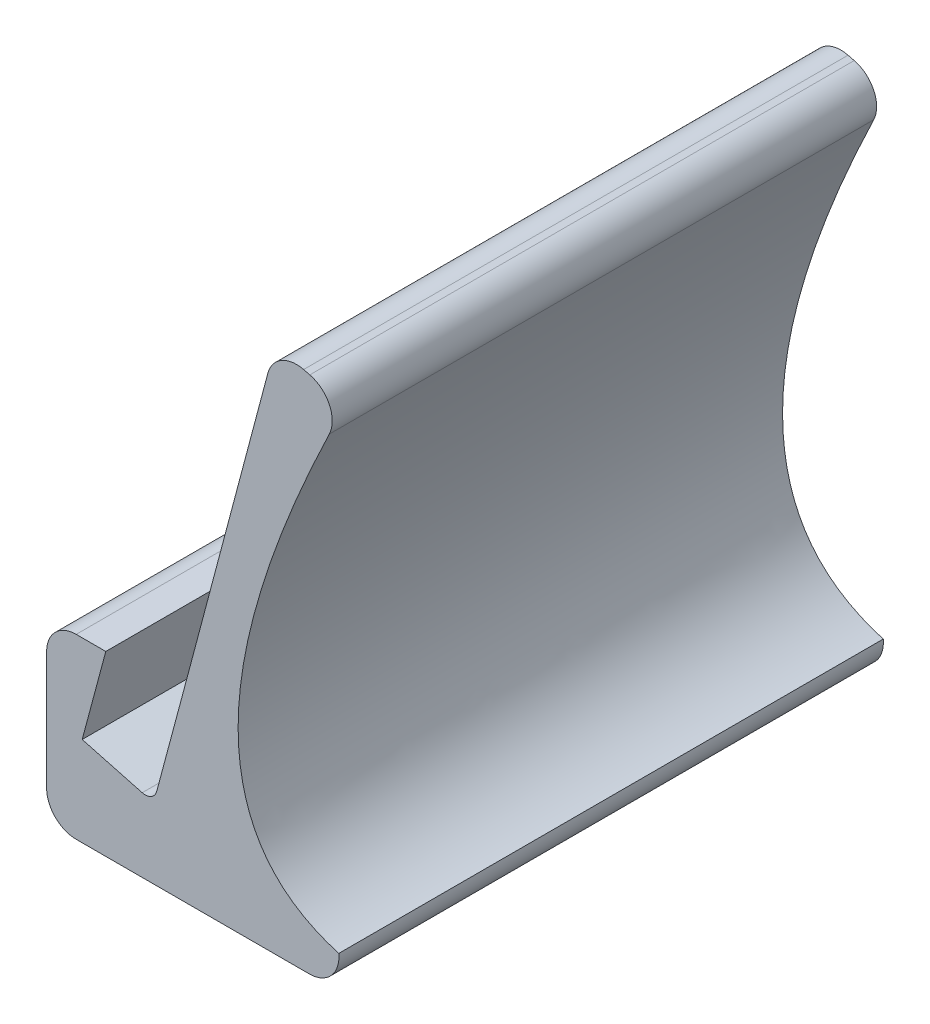
ISO-10303-21;
HEADER;
FILE_DESCRIPTION(('STEP AP214'),'2;1');
FILE_NAME('part.step','',(''),(''),'','','');
FILE_SCHEMA(('AUTOMOTIVE_DESIGN { 1 0 10303 214 1 1 1 1 }'));
ENDSEC;
DATA;
#1=APPLICATION_CONTEXT('core data for automotive mechanical design processes');
#2=APPLICATION_PROTOCOL_DEFINITION('international standard','automotive_design',2000,#1);
#3=PRODUCT_CONTEXT('',#1,'mechanical');
#4=PRODUCT('Part','Part','',(#3));
#5=PRODUCT_RELATED_PRODUCT_CATEGORY('part','',(#4));
#6=PRODUCT_DEFINITION_FORMATION('','',#4);
#7=PRODUCT_DEFINITION_CONTEXT('part definition',#1,'design');
#8=PRODUCT_DEFINITION('design','',#6,#7);
#9=PRODUCT_DEFINITION_SHAPE('','',#8);
#10=(LENGTH_UNIT() NAMED_UNIT(*) SI_UNIT(.MILLI.,.METRE.));
#11=(NAMED_UNIT(*) PLANE_ANGLE_UNIT() SI_UNIT($,.RADIAN.));
#12=(NAMED_UNIT(*) SI_UNIT($,.STERADIAN.) SOLID_ANGLE_UNIT());
#13=UNCERTAINTY_MEASURE_WITH_UNIT(LENGTH_MEASURE(1.E-05),#10,'distance_accuracy_value','');
#14=(GEOMETRIC_REPRESENTATION_CONTEXT(3) GLOBAL_UNCERTAINTY_ASSIGNED_CONTEXT((#13)) GLOBAL_UNIT_ASSIGNED_CONTEXT((#10,
#11,#12)) REPRESENTATION_CONTEXT('',''));
#15=CARTESIAN_POINT('',(0.,0.,0.));
#16=DIRECTION('',(0.,0.,1.));
#17=DIRECTION('',(1.,0.,0.));
#18=AXIS2_PLACEMENT_3D('',#15,#16,#17);
#19=CARTESIAN_POINT('',(3.20431251960095,-44.264262249222,92.));
#20=DIRECTION('',(0.966476092710961,-0.256756620592642,0.));
#21=DIRECTION('',(0.256756620592642,0.966476092710961,0.));
#22=AXIS2_PLACEMENT_3D('',#19,#20,#21);
#23=PLANE('',#22);
#24=DIRECTION('',(0.,0.,-1.));
#25=VECTOR('',#24,1.);
#26=CARTESIAN_POINT('',(30.1602384031822,57.202480315143,5.));
#27=LINE('',#26,#25);
#28=CARTESIAN_POINT('',(30.1602384031822,57.202480315143,35.));
#29=VERTEX_POINT('',#28);
#30=CARTESIAN_POINT('',(30.1602384031822,57.202480315143,0.));
#31=VERTEX_POINT('',#30);
#32=EDGE_CURVE('E645',#29,#31,#27,.T.);
#33=ORIENTED_EDGE('',*,*,#32,.F.);
#34=DIRECTION('',(-0.256756620592642,-0.966476092710961,0.));
#35=VECTOR('',#34,1.);
#36=CARTESIAN_POINT('',(3.20431251960095,-44.264262249222,35.));
#37=LINE('',#36,#35);
#38=CARTESIAN_POINT('',(22.9335548151147,30.,35.));
#39=VERTEX_POINT('',#38);
#40=EDGE_CURVE('E683',#29,#39,#37,.T.);
#41=ORIENTED_EDGE('',*,*,#40,.T.);
#42=DIRECTION('',(0.,0.,-1.));
#43=VECTOR('',#42,1.);
#44=CARTESIAN_POINT('',(22.9335548151147,30.,92.));
#45=LINE('',#44,#43);
#46=CARTESIAN_POINT('',(22.9335548151147,30.,92.));
#47=VERTEX_POINT('',#46);
#48=EDGE_CURVE('E224',#47,#39,#45,.T.);
#49=ORIENTED_EDGE('',*,*,#48,.F.);
#50=DIRECTION('',(-0.256756620592642,-0.966476092710961,0.));
#51=VECTOR('',#50,1.);
#52=CARTESIAN_POINT('',(3.20431251960095,-44.264262249222,92.));
#53=LINE('',#52,#51);
#54=CARTESIAN_POINT('',(37.3869219912498,84.4049606302859,92.));
#55=VERTEX_POINT('',#54);
#56=EDGE_CURVE('E259',#55,#47,#53,.T.);
#57=ORIENTED_EDGE('',*,*,#56,.F.);
#58=DIRECTION('',(0.,0.,-1.));
#59=VECTOR('',#58,1.);
#60=CARTESIAN_POINT('',(37.3869219912498,84.4049606302859,92.));
#61=LINE('',#60,#59);
#62=CARTESIAN_POINT('',(37.3869219912498,84.4049606302859,0.));
#63=VERTEX_POINT('',#62);
#64=EDGE_CURVE('E227',#55,#63,#61,.T.);
#65=ORIENTED_EDGE('',*,*,#64,.T.);
#66=DIRECTION('',(-0.256756620592642,-0.966476092710961,0.));
#67=VECTOR('',#66,1.);
#68=CARTESIAN_POINT('',(3.20431251960095,-44.264262249222,0.));
#69=LINE('',#68,#67);
#70=EDGE_CURVE('E49',#63,#31,#69,.T.);
#71=ORIENTED_EDGE('',*,*,#70,.T.);
#72=EDGE_LOOP('',(#33,#41,#49,#57,#65,#71));
#73=FACE_BOUND('',#72,.T.);
#74=ADVANCED_FACE('F33',(#73),#23,.F.);
#75=CARTESIAN_POINT('',(47.7690185076948,80.6903335074294,92.));
#76=CARTESIAN_POINT('',(37.2373149504594,58.8233243450368,92.));
#77=CARTESIAN_POINT('',(26.9735911685556,24.4249221792162,92.));
#78=CARTESIAN_POINT('',(38.3092340515755,8.69775233143099,92.));
#79=CARTESIAN_POINT('',(49.3768971593338,5.50197548703808,92.));
#80=B_SPLINE_CURVE_WITH_KNOTS('',3,(#75,#76,#77,#78,#79),.UNSPECIFIED.,.F.,.F.,(4,1,4),
(0.03436507316587,0.450207032102534,0.866048991039199),.UNSPECIFIED.);
#81=DIRECTION('',(0.,0.,-1.));
#82=VECTOR('',#81,1.);
#83=SURFACE_OF_LINEAR_EXTRUSION('',#80,#82);
#84=CARTESIAN_POINT('',(47.7690185076948,80.6903335074294,0.));
#85=CARTESIAN_POINT('',(37.2373149504594,58.8233243450368,0.));
#86=CARTESIAN_POINT('',(26.9735911685556,24.4249221792162,0.));
#87=CARTESIAN_POINT('',(38.3092340515755,8.69775233143099,0.));
#88=CARTESIAN_POINT('',(49.3768971593338,5.50197548703808,0.));
#89=B_SPLINE_CURVE_WITH_KNOTS('',3,(#84,#85,#86,#87,#88),.UNSPECIFIED.,.F.,.F.,(4,1,4),
(0.03436507316587,0.450207032102534,0.866048991039199),.UNSPECIFIED.);
#90=CARTESIAN_POINT('',(47.7690185076948,80.6903335074294,0.));
#91=VERTEX_POINT('',#90);
#92=CARTESIAN_POINT('',(49.3768971593338,5.50197548703808,0.));
#93=VERTEX_POINT('',#92);
#94=EDGE_CURVE('E171',#91,#93,#89,.T.);
#95=ORIENTED_EDGE('',*,*,#94,.F.);
#96=DIRECTION('',(0.,0.,-1.));
#97=VECTOR('',#96,1.);
#98=CARTESIAN_POINT('',(47.7690185076948,80.6903335074294,92.));
#99=LINE('',#98,#97);
#100=CARTESIAN_POINT('',(47.7690185076948,80.6903335074294,92.));
#101=VERTEX_POINT('',#100);
#102=EDGE_CURVE('E42',#101,#91,#99,.T.);
#103=ORIENTED_EDGE('',*,*,#102,.F.);
#104=CARTESIAN_POINT('',(49.3768971593338,5.50197548703808,92.));
#105=VERTEX_POINT('',#104);
#106=EDGE_CURVE('E204',#101,#105,#80,.T.);
#107=ORIENTED_EDGE('',*,*,#106,.T.);
#108=DIRECTION('',(0.,0.,-1.));
#109=VECTOR('',#108,1.);
#110=CARTESIAN_POINT('',(49.3768971593338,5.50197548703808,92.));
#111=LINE('',#110,#109);
#112=EDGE_CURVE('E99',#105,#93,#111,.T.);
#113=ORIENTED_EDGE('',*,*,#112,.T.);
#114=EDGE_LOOP('',(#95,#103,#107,#113));
#115=FACE_BOUND('',#114,.T.);
#116=ADVANCED_FACE('F35',(#115),#83,.T.);
#117=CARTESIAN_POINT('',(43.2642633165956,82.859937311875,92.));
#118=DIRECTION('',(0.,0.,-1.));
#119=DIRECTION('',(-1.,0.,0.));
#120=AXIS2_PLACEMENT_3D('',#117,#118,#119);
#121=CYLINDRICAL_SURFACE('',#120,5.00000000000002);
#122=CARTESIAN_POINT('',(43.2642633165956,82.859937311875,0.));
#123=DIRECTION('',(0.,0.,1.));
#124=DIRECTION('',(1.,0.,0.));
#125=AXIS2_PLACEMENT_3D('',#122,#123,#124);
#126=CIRCLE('',#125,5.00000000000002);
#127=CARTESIAN_POINT('',(44.4769414417775,87.7106498126017,0.));
#128=VERTEX_POINT('',#127);
#129=EDGE_CURVE('E176',#128,#91,#126,.F.);
#130=ORIENTED_EDGE('',*,*,#129,.F.);
#131=DIRECTION('',(0.,0.,-1.));
#132=VECTOR('',#131,1.);
#133=CARTESIAN_POINT('',(44.4769414417775,87.7106498126017,92.));
#134=LINE('',#133,#132);
#135=CARTESIAN_POINT('',(44.4769414417775,87.7106498126017,92.));
#136=VERTEX_POINT('',#135);
#137=EDGE_CURVE('E231',#136,#128,#134,.T.);
#138=ORIENTED_EDGE('',*,*,#137,.F.);
#139=CARTESIAN_POINT('',(43.2642633165956,82.859937311875,92.));
#140=DIRECTION('',(0.,0.,1.));
#141=DIRECTION('',(1.,0.,0.));
#142=AXIS2_PLACEMENT_3D('',#139,#140,#141);
#143=CIRCLE('',#142,5.00000000000002);
#144=EDGE_CURVE('E237',#136,#101,#143,.F.);
#145=ORIENTED_EDGE('',*,*,#144,.T.);
#146=ORIENTED_EDGE('',*,*,#102,.T.);
#147=EDGE_LOOP('',(#130,#138,#145,#146));
#148=FACE_BOUND('',#147,.T.);
#149=ADVANCED_FACE('F235',(#148),#121,.T.);
#150=CARTESIAN_POINT('',(62.2357539403664,83.2709466879545,92.));
#151=DIRECTION('',(0.242535625036328,0.970142500145333,0.));
#152=DIRECTION('',(-0.970142500145333,0.242535625036328,0.));
#153=AXIS2_PLACEMENT_3D('',#150,#151,#152);
#154=PLANE('',#153);
#155=DIRECTION('',(0.970142500145333,-0.242535625036328,0.));
#156=VECTOR('',#155,1.);
#157=CARTESIAN_POINT('',(62.2357539403664,83.2709466879545,0.));
#158=LINE('',#157,#156);
#159=CARTESIAN_POINT('',(43.4319805799863,87.9718900280495,0.));
#160=VERTEX_POINT('',#159);
#161=EDGE_CURVE('E183',#160,#128,#158,.T.);
#162=ORIENTED_EDGE('',*,*,#161,.F.);
#163=DIRECTION('',(0.,0.,-1.));
#164=VECTOR('',#163,1.);
#165=CARTESIAN_POINT('',(43.4319805799863,87.9718900280495,92.));
#166=LINE('',#165,#164);
#167=CARTESIAN_POINT('',(43.4319805799863,87.9718900280495,92.));
#168=VERTEX_POINT('',#167);
#169=EDGE_CURVE('E229',#168,#160,#166,.T.);
#170=ORIENTED_EDGE('',*,*,#169,.F.);
#171=DIRECTION('',(0.970142500145333,-0.242535625036328,0.));
#172=VECTOR('',#171,1.);
#173=CARTESIAN_POINT('',(62.2357539403664,83.2709466879545,92.));
#174=LINE('',#173,#172);
#175=EDGE_CURVE('E247',#168,#136,#174,.T.);
#176=ORIENTED_EDGE('',*,*,#175,.T.);
#177=ORIENTED_EDGE('',*,*,#137,.T.);
#178=EDGE_LOOP('',(#162,#170,#176,#177));
#179=FACE_BOUND('',#178,.T.);
#180=ADVANCED_FACE('F244',(#179),#154,.T.);
#181=CARTESIAN_POINT('',(42.2193024548046,83.1211775273228,92.));
#182=DIRECTION('',(0.,0.,-1.));
#183=DIRECTION('',(-1.,0.,0.));
#184=AXIS2_PLACEMENT_3D('',#181,#182,#183);
#185=CYLINDRICAL_SURFACE('',#184,5.);
#186=CARTESIAN_POINT('',(42.2193024548046,83.1211775273228,0.));
#187=DIRECTION('',(0.,0.,1.));
#188=DIRECTION('',(1.,0.,0.));
#189=AXIS2_PLACEMENT_3D('',#186,#187,#188);
#190=CIRCLE('',#189,5.);
#191=EDGE_CURVE('E186',#63,#160,#190,.F.);
#192=ORIENTED_EDGE('',*,*,#191,.F.);
#193=ORIENTED_EDGE('',*,*,#64,.F.);
#194=CARTESIAN_POINT('',(42.2193024548046,83.1211775273228,92.));
#195=DIRECTION('',(0.,0.,1.));
#196=DIRECTION('',(1.,0.,0.));
#197=AXIS2_PLACEMENT_3D('',#194,#195,#196);
#198=CIRCLE('',#197,5.);
#199=EDGE_CURVE('E251',#55,#168,#198,.F.);
#200=ORIENTED_EDGE('',*,*,#199,.T.);
#201=ORIENTED_EDGE('',*,*,#169,.T.);
#202=EDGE_LOOP('',(#192,#193,#200,#201));
#203=FACE_BOUND('',#202,.T.);
#204=ADVANCED_FACE('F305',(#203),#185,.T.);
#205=CARTESIAN_POINT('',(3.08608733305023,-44.1848204094433,92.));
#206=DIRECTION('',(-0.966024381248637,0.258450952471041,0.));
#207=DIRECTION('',(-0.258450952471041,-0.966024381248637,0.));
#208=AXIS2_PLACEMENT_3D('',#205,#206,#207);
#209=PLANE('',#208);
#210=DIRECTION('',(0.258450952471041,0.966024381248637,0.));
#211=VECTOR('',#210,1.);
#212=CARTESIAN_POINT('',(3.08608733305023,-44.1848204094433,35.));
#213=LINE('',#212,#211);
#214=CARTESIAN_POINT('',(18.604332549612,13.8184606389151,35.));
#215=VERTEX_POINT('',#214);
#216=EDGE_CURVE('E695',#215,#39,#213,.T.);
#217=ORIENTED_EDGE('',*,*,#216,.F.);
#218=DIRECTION('',(0.,0.,-1.));
#219=VECTOR('',#218,1.);
#220=CARTESIAN_POINT('',(18.604332549612,13.8184606389151,92.));
#221=LINE('',#220,#219);
#222=CARTESIAN_POINT('',(18.604332549612,13.8184606389151,92.));
#223=VERTEX_POINT('',#222);
#224=EDGE_CURVE('E221',#223,#215,#221,.T.);
#225=ORIENTED_EDGE('',*,*,#224,.F.);
#226=DIRECTION('',(0.258450952471041,0.966024381248637,0.));
#227=VECTOR('',#226,1.);
#228=CARTESIAN_POINT('',(3.08608733305023,-44.1848204094433,92.));
#229=LINE('',#228,#227);
#230=EDGE_CURVE('E261',#223,#47,#229,.T.);
#231=ORIENTED_EDGE('',*,*,#230,.T.);
#232=ORIENTED_EDGE('',*,*,#48,.T.);
#233=EDGE_LOOP('',(#217,#225,#231,#232));
#234=FACE_BOUND('',#233,.T.);
#235=ADVANCED_FACE('F303',(#234),#209,.T.);
#236=CARTESIAN_POINT('',(16.6722837871147,14.3353625438572,92.));
#237=DIRECTION('',(0.,0.,-1.));
#238=DIRECTION('',(-1.,0.,0.));
#239=AXIS2_PLACEMENT_3D('',#236,#237,#238);
#240=CYLINDRICAL_SURFACE('',#239,2.);
#241=CARTESIAN_POINT('',(16.6722837871147,14.3353625438572,35.));
#242=DIRECTION('',(0.,0.,1.));
#243=DIRECTION('',(1.,0.,0.));
#244=AXIS2_PLACEMENT_3D('',#241,#242,#243);
#245=CIRCLE('',#244,2.);
#246=CARTESIAN_POINT('',(16.1546456969097,12.4035108912791,35.));
#247=VERTEX_POINT('',#246);
#248=EDGE_CURVE('E698',#247,#215,#245,.T.);
#249=ORIENTED_EDGE('',*,*,#248,.F.);
#250=DIRECTION('',(0.,0.,-1.));
#251=VECTOR('',#250,1.);
#252=CARTESIAN_POINT('',(16.1546456969097,12.4035108912791,92.));
#253=LINE('',#252,#251);
#254=CARTESIAN_POINT('',(16.1546456969097,12.4035108912791,92.));
#255=VERTEX_POINT('',#254);
#256=EDGE_CURVE('E218',#255,#247,#253,.T.);
#257=ORIENTED_EDGE('',*,*,#256,.F.);
#258=CARTESIAN_POINT('',(16.6722837871147,14.3353625438572,92.));
#259=DIRECTION('',(0.,0.,1.));
#260=DIRECTION('',(1.,0.,0.));
#261=AXIS2_PLACEMENT_3D('',#258,#259,#260);
#262=CIRCLE('',#261,2.);
#263=EDGE_CURVE('E264',#255,#223,#262,.T.);
#264=ORIENTED_EDGE('',*,*,#263,.T.);
#265=ORIENTED_EDGE('',*,*,#224,.T.);
#266=EDGE_LOOP('',(#249,#257,#264,#265));
#267=FACE_BOUND('',#266,.T.);
#268=ADVANCED_FACE('F330',(#267),#240,.F.);
#269=CARTESIAN_POINT('',(43.6811137347156,5.0278160100681,92.));
#270=DIRECTION('',(0.258819045102514,0.96592582628907,0.));
#271=DIRECTION('',(-0.96592582628907,0.258819045102514,0.));
#272=AXIS2_PLACEMENT_3D('',#269,#270,#271);
#273=PLANE('',#272);
#274=DIRECTION('',(0.96592582628907,-0.258819045102514,0.));
#275=VECTOR('',#274,1.);
#276=CARTESIAN_POINT('',(43.6811137347156,5.0278160100681,35.));
#277=LINE('',#276,#275);
#278=CARTESIAN_POINT('',(6.0131608088665,15.1209135770826,35.));
#279=VERTEX_POINT('',#278);
#280=EDGE_CURVE('E701',#279,#247,#277,.T.);
#281=ORIENTED_EDGE('',*,*,#280,.F.);
#282=DIRECTION('',(0.,0.,-1.));
#283=VECTOR('',#282,1.);
#284=CARTESIAN_POINT('',(6.0131608088665,15.1209135770826,92.));
#285=LINE('',#284,#283);
#286=CARTESIAN_POINT('',(6.0131608088665,15.1209135770826,92.));
#287=VERTEX_POINT('',#286);
#288=EDGE_CURVE('E215',#287,#279,#285,.T.);
#289=ORIENTED_EDGE('',*,*,#288,.F.);
#290=DIRECTION('',(0.96592582628907,-0.258819045102514,0.));
#291=VECTOR('',#290,1.);
#292=CARTESIAN_POINT('',(43.6811137347156,5.0278160100681,92.));
#293=LINE('',#292,#291);
#294=EDGE_CURVE('E267',#287,#255,#293,.T.);
#295=ORIENTED_EDGE('',*,*,#294,.T.);
#296=ORIENTED_EDGE('',*,*,#256,.T.);
#297=EDGE_LOOP('',(#281,#289,#295,#296));
#298=FACE_BOUND('',#297,.T.);
#299=ADVANCED_FACE('F337',(#298),#273,.T.);
#300=CARTESIAN_POINT('',(-9.00673836965725,-40.9341132817314,92.));
#301=DIRECTION('',(0.96592582628907,-0.258819045102515,0.));
#302=DIRECTION('',(0.258819045102515,0.96592582628907,0.));
#303=AXIS2_PLACEMENT_3D('',#300,#301,#302);
#304=PLANE('',#303);
#305=DIRECTION('',(-0.258819045102515,-0.96592582628907,0.));
#306=VECTOR('',#305,1.);
#307=CARTESIAN_POINT('',(-9.00673836965725,-40.9341132817314,35.));
#308=LINE('',#307,#306);
#309=CARTESIAN_POINT('',(10.,30.,35.));
#310=VERTEX_POINT('',#309);
#311=EDGE_CURVE('E704',#310,#279,#308,.T.);
#312=ORIENTED_EDGE('',*,*,#311,.F.);
#313=DIRECTION('',(0.,0.,-1.));
#314=VECTOR('',#313,1.);
#315=CARTESIAN_POINT('',(10.,30.,92.));
#316=LINE('',#315,#314);
#317=CARTESIAN_POINT('',(10.,30.,92.));
#318=VERTEX_POINT('',#317);
#319=EDGE_CURVE('E212',#318,#310,#316,.T.);
#320=ORIENTED_EDGE('',*,*,#319,.F.);
#321=DIRECTION('',(-0.258819045102515,-0.96592582628907,0.));
#322=VECTOR('',#321,1.);
#323=CARTESIAN_POINT('',(-9.00673836965725,-40.9341132817314,92.));
#324=LINE('',#323,#322);
#325=EDGE_CURVE('E270',#318,#287,#324,.T.);
#326=ORIENTED_EDGE('',*,*,#325,.T.);
#327=ORIENTED_EDGE('',*,*,#288,.T.);
#328=EDGE_LOOP('',(#312,#320,#326,#327));
#329=FACE_BOUND('',#328,.T.);
#330=ADVANCED_FACE('F344',(#329),#304,.T.);
#331=CARTESIAN_POINT('',(28.6612145561919,30.,92.));
#332=DIRECTION('',(0.,1.,0.));
#333=DIRECTION('',(0.,0.,1.));
#334=AXIS2_PLACEMENT_3D('',#331,#332,#333);
#335=PLANE('',#334);
#336=DIRECTION('',(1.,0.,0.));
#337=VECTOR('',#336,1.);
#338=CARTESIAN_POINT('',(28.6612145561919,30.,0.));
#339=LINE('',#338,#337);
#340=CARTESIAN_POINT('',(5.00000000000004,30.,0.));
#341=VERTEX_POINT('',#340);
#342=CARTESIAN_POINT('',(10.,30.,0.));
#343=VERTEX_POINT('',#342);
#344=EDGE_CURVE('E190',#341,#343,#339,.T.);
#345=ORIENTED_EDGE('',*,*,#344,.F.);
#346=DIRECTION('',(0.,0.,-1.));
#347=VECTOR('',#346,1.);
#348=CARTESIAN_POINT('',(5.00000000000004,30.,92.));
#349=LINE('',#348,#347);
#350=CARTESIAN_POINT('',(5.00000000000004,30.,92.));
#351=VERTEX_POINT('',#350);
#352=EDGE_CURVE('E210',#351,#341,#349,.T.);
#353=ORIENTED_EDGE('',*,*,#352,.F.);
#354=DIRECTION('',(1.,0.,0.));
#355=VECTOR('',#354,1.);
#356=CARTESIAN_POINT('',(28.6612145561919,30.,92.));
#357=LINE('',#356,#355);
#358=EDGE_CURVE('E273',#351,#318,#357,.T.);
#359=ORIENTED_EDGE('',*,*,#358,.T.);
#360=ORIENTED_EDGE('',*,*,#319,.T.);
#361=DIRECTION('',(0.,0.,-1.));
#362=VECTOR('',#361,1.);
#363=CARTESIAN_POINT('',(10.,30.,5.));
#364=LINE('',#363,#362);
#365=EDGE_CURVE('E647',#310,#343,#364,.T.);
#366=ORIENTED_EDGE('',*,*,#365,.T.);
#367=EDGE_LOOP('',(#345,#353,#359,#360,#366));
#368=FACE_BOUND('',#367,.T.);
#369=ADVANCED_FACE('F352',(#368),#335,.T.);
#370=CARTESIAN_POINT('',(5.,25.,92.));
#371=DIRECTION('',(0.,0.,-1.));
#372=DIRECTION('',(-1.,0.,0.));
#373=AXIS2_PLACEMENT_3D('',#370,#371,#372);
#374=CYLINDRICAL_SURFACE('',#373,5.);
#375=CARTESIAN_POINT('',(5.,25.,0.));
#376=DIRECTION('',(0.,0.,1.));
#377=DIRECTION('',(1.,0.,0.));
#378=AXIS2_PLACEMENT_3D('',#375,#376,#377);
#379=CIRCLE('',#378,5.);
#380=CARTESIAN_POINT('',(0.,25.,0.));
#381=VERTEX_POINT('',#380);
#382=EDGE_CURVE('E193',#381,#341,#379,.F.);
#383=ORIENTED_EDGE('',*,*,#382,.F.);
#384=DIRECTION('',(0.,0.,-1.));
#385=VECTOR('',#384,1.);
#386=CARTESIAN_POINT('',(0.,25.,92.));
#387=LINE('',#386,#385);
#388=CARTESIAN_POINT('',(0.,25.,92.));
#389=VERTEX_POINT('',#388);
#390=EDGE_CURVE('E208',#389,#381,#387,.T.);
#391=ORIENTED_EDGE('',*,*,#390,.F.);
#392=CARTESIAN_POINT('',(5.,25.,92.));
#393=DIRECTION('',(0.,0.,1.));
#394=DIRECTION('',(1.,0.,0.));
#395=AXIS2_PLACEMENT_3D('',#392,#393,#394);
#396=CIRCLE('',#395,5.);
#397=EDGE_CURVE('E166',#389,#351,#396,.F.);
#398=ORIENTED_EDGE('',*,*,#397,.T.);
#399=ORIENTED_EDGE('',*,*,#352,.T.);
#400=EDGE_LOOP('',(#383,#391,#398,#399));
#401=FACE_BOUND('',#400,.T.);
#402=ADVANCED_FACE('F278',(#401),#374,.T.);
#403=CARTESIAN_POINT('',(0.,-51.027210848746,92.));
#404=DIRECTION('',(-1.,0.,0.));
#405=DIRECTION('',(0.,0.,1.));
#406=AXIS2_PLACEMENT_3D('',#403,#404,#405);
#407=PLANE('',#406);
#408=DIRECTION('',(0.,1.,0.));
#409=VECTOR('',#408,1.);
#410=CARTESIAN_POINT('',(0.,-51.027210848746,0.));
#411=LINE('',#410,#409);
#412=CARTESIAN_POINT('',(0.,5.00000000000004,0.));
#413=VERTEX_POINT('',#412);
#414=EDGE_CURVE('E196',#413,#381,#411,.T.);
#415=ORIENTED_EDGE('',*,*,#414,.F.);
#416=DIRECTION('',(0.,0.,-1.));
#417=VECTOR('',#416,1.);
#418=CARTESIAN_POINT('',(0.,5.00000000000004,92.));
#419=LINE('',#418,#417);
#420=CARTESIAN_POINT('',(0.,5.00000000000004,92.));
#421=VERTEX_POINT('',#420);
#422=EDGE_CURVE('E152',#421,#413,#419,.T.);
#423=ORIENTED_EDGE('',*,*,#422,.F.);
#424=DIRECTION('',(0.,1.,0.));
#425=VECTOR('',#424,1.);
#426=CARTESIAN_POINT('',(0.,-51.027210848746,92.));
#427=LINE('',#426,#425);
#428=EDGE_CURVE('E164',#421,#389,#427,.T.);
#429=ORIENTED_EDGE('',*,*,#428,.T.);
#430=ORIENTED_EDGE('',*,*,#390,.T.);
#431=EDGE_LOOP('',(#415,#423,#429,#430));
#432=FACE_BOUND('',#431,.T.);
#433=ADVANCED_FACE('F284',(#432),#407,.T.);
#434=CARTESIAN_POINT('',(5.,5.,92.));
#435=DIRECTION('',(0.,0.,-1.));
#436=DIRECTION('',(-1.,0.,0.));
#437=AXIS2_PLACEMENT_3D('',#434,#435,#436);
#438=CYLINDRICAL_SURFACE('',#437,5.);
#439=CARTESIAN_POINT('',(5.,5.,0.));
#440=DIRECTION('',(0.,0.,1.));
#441=DIRECTION('',(1.,0.,0.));
#442=AXIS2_PLACEMENT_3D('',#439,#440,#441);
#443=CIRCLE('',#442,5.);
#444=CARTESIAN_POINT('',(5.00000000000004,0.,0.));
#445=VERTEX_POINT('',#444);
#446=EDGE_CURVE('E149',#445,#413,#443,.F.);
#447=ORIENTED_EDGE('',*,*,#446,.F.);
#448=DIRECTION('',(0.,0.,-1.));
#449=VECTOR('',#448,1.);
#450=CARTESIAN_POINT('',(5.00000000000004,0.,92.));
#451=LINE('',#450,#449);
#452=CARTESIAN_POINT('',(5.00000000000004,0.,92.));
#453=VERTEX_POINT('',#452);
#454=EDGE_CURVE('E143',#453,#445,#451,.T.);
#455=ORIENTED_EDGE('',*,*,#454,.F.);
#456=CARTESIAN_POINT('',(5.,5.,92.));
#457=DIRECTION('',(0.,0.,1.));
#458=DIRECTION('',(1.,0.,0.));
#459=AXIS2_PLACEMENT_3D('',#456,#457,#458);
#460=CIRCLE('',#459,5.);
#461=EDGE_CURVE('E147',#453,#421,#460,.F.);
#462=ORIENTED_EDGE('',*,*,#461,.T.);
#463=ORIENTED_EDGE('',*,*,#422,.T.);
#464=EDGE_LOOP('',(#447,#455,#462,#463));
#465=FACE_BOUND('',#464,.T.);
#466=ADVANCED_FACE('F145',(#465),#438,.T.);
#467=CARTESIAN_POINT('',(28.6612145561919,0.,92.));
#468=DIRECTION('',(0.,1.,0.));
#469=DIRECTION('',(0.,0.,1.));
#470=AXIS2_PLACEMENT_3D('',#467,#468,#469);
#471=PLANE('',#470);
#472=DIRECTION('',(1.,0.,0.));
#473=VECTOR('',#472,1.);
#474=CARTESIAN_POINT('',(28.6612145561919,0.,0.));
#475=LINE('',#474,#473);
#476=CARTESIAN_POINT('',(44.402158913917,0.,0.));
#477=VERTEX_POINT('',#476);
#478=EDGE_CURVE('E200',#445,#477,#475,.T.);
#479=ORIENTED_EDGE('',*,*,#478,.T.);
#480=DIRECTION('',(0.,0.,-1.));
#481=VECTOR('',#480,1.);
#482=CARTESIAN_POINT('',(44.402158913917,0.,92.));
#483=LINE('',#482,#481);
#484=CARTESIAN_POINT('',(44.402158913917,0.,92.));
#485=VERTEX_POINT('',#484);
#486=EDGE_CURVE('E153',#485,#477,#483,.T.);
#487=ORIENTED_EDGE('',*,*,#486,.F.);
#488=DIRECTION('',(1.,0.,0.));
#489=VECTOR('',#488,1.);
#490=CARTESIAN_POINT('',(28.6612145561919,0.,92.));
#491=LINE('',#490,#489);
#492=EDGE_CURVE('E156',#453,#485,#491,.T.);
#493=ORIENTED_EDGE('',*,*,#492,.F.);
#494=ORIENTED_EDGE('',*,*,#454,.T.);
#495=EDGE_LOOP('',(#479,#487,#493,#494));
#496=FACE_BOUND('',#495,.T.);
#497=ADVANCED_FACE('F157',(#496),#471,.F.);
#498=CARTESIAN_POINT('',(44.402158913917,5.,92.));
#499=DIRECTION('',(0.,0.,-1.));
#500=DIRECTION('',(-1.,0.,0.));
#501=AXIS2_PLACEMENT_3D('',#498,#499,#500);
#502=CYLINDRICAL_SURFACE('',#501,5.);
#503=CARTESIAN_POINT('',(44.402158913917,5.,0.));
#504=DIRECTION('',(0.,0.,1.));
#505=DIRECTION('',(1.,0.,0.));
#506=AXIS2_PLACEMENT_3D('',#503,#504,#505);
#507=CIRCLE('',#506,5.);
#508=EDGE_CURVE('E202',#477,#93,#507,.T.);
#509=ORIENTED_EDGE('',*,*,#508,.T.);
#510=ORIENTED_EDGE('',*,*,#112,.F.);
#511=CARTESIAN_POINT('',(44.402158913917,5.,92.));
#512=DIRECTION('',(0.,0.,1.));
#513=DIRECTION('',(1.,0.,0.));
#514=AXIS2_PLACEMENT_3D('',#511,#512,#513);
#515=CIRCLE('',#514,5.);
#516=EDGE_CURVE('E58',#485,#105,#515,.T.);
#517=ORIENTED_EDGE('',*,*,#516,.F.);
#518=ORIENTED_EDGE('',*,*,#486,.T.);
#519=EDGE_LOOP('',(#509,#510,#517,#518));
#520=FACE_BOUND('',#519,.T.);
#521=ADVANCED_FACE('F286',(#520),#502,.T.);
#522=CARTESIAN_POINT('',(28.6612145561919,-51.027210848746,92.));
#523=DIRECTION('',(0.,0.,1.));
#524=DIRECTION('',(1.,0.,0.));
#525=AXIS2_PLACEMENT_3D('',#522,#523,#524);
#526=PLANE('',#525);
#527=ORIENTED_EDGE('',*,*,#106,.F.);
#528=ORIENTED_EDGE('',*,*,#144,.F.);
#529=ORIENTED_EDGE('',*,*,#175,.F.);
#530=ORIENTED_EDGE('',*,*,#199,.F.);
#531=ORIENTED_EDGE('',*,*,#56,.T.);
#532=ORIENTED_EDGE('',*,*,#230,.F.);
#533=ORIENTED_EDGE('',*,*,#263,.F.);
#534=ORIENTED_EDGE('',*,*,#294,.F.);
#535=ORIENTED_EDGE('',*,*,#325,.F.);
#536=ORIENTED_EDGE('',*,*,#358,.F.);
#537=ORIENTED_EDGE('',*,*,#397,.F.);
#538=ORIENTED_EDGE('',*,*,#428,.F.);
#539=ORIENTED_EDGE('',*,*,#461,.F.);
#540=ORIENTED_EDGE('',*,*,#492,.T.);
#541=ORIENTED_EDGE('',*,*,#516,.T.);
#542=EDGE_LOOP('',(#527,#528,#529,#530,#531,#532,#533,#534,#535,#536,#537,#538,#539,#540,#541));
#543=FACE_BOUND('',#542,.T.);
#544=ADVANCED_FACE('F161',(#543),#526,.T.);
#545=CARTESIAN_POINT('',(28.6612145561919,-51.027210848746,0.));
#546=DIRECTION('',(0.,0.,1.));
#547=DIRECTION('',(1.,0.,0.));
#548=AXIS2_PLACEMENT_3D('',#545,#546,#547);
#549=PLANE('',#548);
#550=ORIENTED_EDGE('',*,*,#94,.T.);
#551=ORIENTED_EDGE('',*,*,#508,.F.);
#552=ORIENTED_EDGE('',*,*,#478,.F.);
#553=ORIENTED_EDGE('',*,*,#446,.T.);
#554=ORIENTED_EDGE('',*,*,#414,.T.);
#555=ORIENTED_EDGE('',*,*,#382,.T.);
#556=ORIENTED_EDGE('',*,*,#344,.T.);
#557=DIRECTION('',(0.242535625036332,0.970142500145332,0.));
#558=VECTOR('',#557,1.);
#559=CARTESIAN_POINT('',(-7.96750757875241,-41.87003031501,0.));
#560=LINE('',#559,#558);
#561=CARTESIAN_POINT('',(12.9078850725104,41.6315402900417,0.));
#562=VERTEX_POINT('',#561);
#563=EDGE_CURVE('E616',#343,#562,#560,.T.);
#564=ORIENTED_EDGE('',*,*,#563,.T.);
#565=DIRECTION('',(0.970142500145332,-0.242535625036331,0.));
#566=VECTOR('',#565,1.);
#567=CARTESIAN_POINT('',(49.5366072074547,32.4743597563057,0.));
#568=LINE('',#567,#566);
#569=CARTESIAN_POINT('',(19.1944049243238,40.0599103270883,0.));
#570=VERTEX_POINT('',#569);
#571=EDGE_CURVE('E611',#562,#570,#568,.T.);
#572=ORIENTED_EDGE('',*,*,#571,.T.);
#573=DIRECTION('',(-0.242535625036331,-0.970142500145332,0.));
#574=VECTOR('',#573,1.);
#575=CARTESIAN_POINT('',(-1.68098772693898,-43.4416602779633,0.));
#576=LINE('',#575,#574);
#577=CARTESIAN_POINT('',(20.0432796119509,43.455409077597,0.));
#578=VERTEX_POINT('',#577);
#579=EDGE_CURVE('E608',#578,#570,#576,.T.);
#580=ORIENTED_EDGE('',*,*,#579,.F.);
#581=CARTESIAN_POINT('',(20.5283508620236,45.3956940778877,0.));
#582=DIRECTION('',(0.,0.,1.));
#583=DIRECTION('',(1.,0.,0.));
#584=AXIS2_PLACEMENT_3D('',#581,#582,#583);
#585=CIRCLE('',#584,2.);
#586=CARTESIAN_POINT('',(21.0134221120963,47.3359790781783,0.));
#587=VERTEX_POINT('',#586);
#588=EDGE_CURVE('E601',#578,#587,#585,.T.);
#589=ORIENTED_EDGE('',*,*,#588,.T.);
#590=DIRECTION('',(0.970142500145332,-0.242535625036331,0.));
#591=VECTOR('',#590,1.);
#592=CARTESIAN_POINT('',(51.3556243952272,39.7504285073957,0.));
#593=LINE('',#592,#591);
#594=CARTESIAN_POINT('',(17.8604589866239,48.1242198595464,0.));
#595=VERTEX_POINT('',#594);
#596=EDGE_CURVE('E588',#595,#587,#593,.T.);
#597=ORIENTED_EDGE('',*,*,#596,.F.);
#598=DIRECTION('',(-0.242535625036331,-0.970142500145333,0.));
#599=VECTOR('',#598,1.);
#600=CARTESIAN_POINT('',(-4.83395085241126,-42.6534194965953,0.));
#601=LINE('',#600,#599);
#602=CARTESIAN_POINT('',(16.8903164864786,44.2436498589651,0.));
#603=VERTEX_POINT('',#602);
#604=EDGE_CURVE('E602',#595,#603,#601,.T.);
#605=ORIENTED_EDGE('',*,*,#604,.T.);
#606=DIRECTION('',(0.970142500145332,-0.242535625036332,0.));
#607=VECTOR('',#606,1.);
#608=CARTESIAN_POINT('',(50.3854818950819,35.8698585068143,0.));
#609=LINE('',#608,#607);
#610=CARTESIAN_POINT('',(13.7567597601376,45.0270390405503,0.));
#611=VERTEX_POINT('',#610);
#612=EDGE_CURVE('E628',#611,#603,#609,.T.);
#613=ORIENTED_EDGE('',*,*,#612,.F.);
#614=DIRECTION('',(0.242535625036331,0.970142500145332,0.));
#615=VECTOR('',#614,1.);
#616=CARTESIAN_POINT('',(-7.96750757875236,-41.87003031501,0.));
#617=LINE('',#616,#615);
#618=CARTESIAN_POINT('',(16.3940526683061,55.5762106732247,0.));
#619=VERTEX_POINT('',#618);
#620=EDGE_CURVE('E625',#611,#619,#617,.T.);
#621=ORIENTED_EDGE('',*,*,#620,.T.);
#622=CARTESIAN_POINT('',(21.2447651690328,54.3635325480431,0.));
#623=DIRECTION('',(0.,0.,1.));
#624=DIRECTION('',(1.,0.,0.));
#625=AXIS2_PLACEMENT_3D('',#622,#623,#624);
#626=CIRCLE('',#625,5.);
#627=CARTESIAN_POINT('',(22.5084187675882,59.2012158347887,0.));
#628=VERTEX_POINT('',#627);
#629=EDGE_CURVE('E622',#628,#619,#626,.T.);
#630=ORIENTED_EDGE('',*,*,#629,.F.);
#631=DIRECTION('',(-0.967536657349127,0.252730719711074,0.));
#632=VECTOR('',#631,1.);
#633=CARTESIAN_POINT('',(55.2219604092097,50.6560957501015,0.));
#634=LINE('',#633,#632);
#635=EDGE_CURVE('E619',#31,#628,#634,.T.);
#636=ORIENTED_EDGE('',*,*,#635,.F.);
#637=ORIENTED_EDGE('',*,*,#70,.F.);
#638=ORIENTED_EDGE('',*,*,#191,.T.);
#639=ORIENTED_EDGE('',*,*,#161,.T.);
#640=ORIENTED_EDGE('',*,*,#129,.T.);
#641=EDGE_LOOP('',(#550,#551,#552,#553,#554,#555,#556,#564,#572,#580,#589,#597,#605,#613,#621,
#630,#636,#637,#638,#639,#640));
#642=FACE_BOUND('',#641,.T.);
#643=ADVANCED_FACE('F240',(#642),#549,.F.);
#644=CARTESIAN_POINT('',(-4.83395085241126,-42.6534194965953,5.));
#645=DIRECTION('',(0.970142500145333,-0.242535625036331,0.));
#646=DIRECTION('',(0.242535625036331,0.970142500145333,0.));
#647=AXIS2_PLACEMENT_3D('',#644,#645,#646);
#648=PLANE('',#647);
#649=ORIENTED_EDGE('',*,*,#604,.F.);
#650=DIRECTION('',(0.,0.,-1.));
#651=VECTOR('',#650,1.);
#652=CARTESIAN_POINT('',(17.8604589866239,48.1242198595464,5.));
#653=LINE('',#652,#651);
#654=CARTESIAN_POINT('',(17.8604589866239,48.1242198595464,5.));
#655=VERTEX_POINT('',#654);
#656=EDGE_CURVE('E177',#655,#595,#653,.T.);
#657=ORIENTED_EDGE('',*,*,#656,.F.);
#658=DIRECTION('',(-0.242535625036331,-0.970142500145333,0.));
#659=VECTOR('',#658,1.);
#660=CARTESIAN_POINT('',(-4.83395085241126,-42.6534194965953,5.));
#661=LINE('',#660,#659);
#662=CARTESIAN_POINT('',(18.7093336742511,51.5197186100551,5.));
#663=VERTEX_POINT('',#662);
#664=EDGE_CURVE('E690',#663,#655,#661,.T.);
#665=ORIENTED_EDGE('',*,*,#664,.F.);
#666=DIRECTION('',(0.,0.,-1.));
#667=VECTOR('',#666,1.);
#668=CARTESIAN_POINT('',(18.7093336742511,51.5197186100551,35.));
#669=LINE('',#668,#667);
#670=CARTESIAN_POINT('',(18.7093336742511,51.5197186100551,35.));
#671=VERTEX_POINT('',#670);
#672=EDGE_CURVE('E668',#671,#663,#669,.T.);
#673=ORIENTED_EDGE('',*,*,#672,.F.);
#674=DIRECTION('',(-0.242535625036331,-0.970142500145333,0.));
#675=VECTOR('',#674,1.);
#676=CARTESIAN_POINT('',(-4.83395085241126,-42.6534194965953,35.));
#677=LINE('',#676,#675);
#678=CARTESIAN_POINT('',(16.8903164864786,44.2436498589651,35.));
#679=VERTEX_POINT('',#678);
#680=EDGE_CURVE('E719',#671,#679,#677,.T.);
#681=ORIENTED_EDGE('',*,*,#680,.T.);
#682=DIRECTION('',(0.,0.,-1.));
#683=VECTOR('',#682,1.);
#684=CARTESIAN_POINT('',(16.8903164864786,44.2436498589651,5.));
#685=LINE('',#684,#683);
#686=EDGE_CURVE('E632',#679,#603,#685,.T.);
#687=ORIENTED_EDGE('',*,*,#686,.T.);
#688=EDGE_LOOP('',(#649,#657,#665,#673,#681,#687));
#689=FACE_BOUND('',#688,.T.);
#690=ADVANCED_FACE('F403',(#689),#648,.T.);
#691=CARTESIAN_POINT('',(51.3556243952272,39.7504285073957,5.));
#692=DIRECTION('',(0.242535625036332,0.970142500145332,0.));
#693=DIRECTION('',(-0.970142500145332,0.242535625036332,0.));
#694=AXIS2_PLACEMENT_3D('',#691,#692,#693);
#695=PLANE('',#694);
#696=ORIENTED_EDGE('',*,*,#596,.T.);
#697=DIRECTION('',(0.,0.,-1.));
#698=VECTOR('',#697,1.);
#699=CARTESIAN_POINT('',(21.0134221120963,47.3359790781783,5.));
#700=LINE('',#699,#698);
#701=CARTESIAN_POINT('',(21.0134221120963,47.3359790781783,5.));
#702=VERTEX_POINT('',#701);
#703=EDGE_CURVE('E593',#702,#587,#700,.T.);
#704=ORIENTED_EDGE('',*,*,#703,.F.);
#705=DIRECTION('',(0.970142500145332,-0.242535625036331,0.));
#706=VECTOR('',#705,1.);
#707=CARTESIAN_POINT('',(51.3556243952272,39.7504285073957,5.));
#708=LINE('',#707,#706);
#709=EDGE_CURVE('E631',#655,#702,#708,.T.);
#710=ORIENTED_EDGE('',*,*,#709,.F.);
#711=ORIENTED_EDGE('',*,*,#656,.T.);
#712=EDGE_LOOP('',(#696,#704,#710,#711));
#713=FACE_BOUND('',#712,.T.);
#714=ADVANCED_FACE('F415',(#713),#695,.F.);
#715=CARTESIAN_POINT('',(20.5283508620236,45.3956940778877,5.));
#716=DIRECTION('',(0.,0.,-1.));
#717=DIRECTION('',(-1.,0.,0.));
#718=AXIS2_PLACEMENT_3D('',#715,#716,#717);
#719=CYLINDRICAL_SURFACE('',#718,2.);
#720=ORIENTED_EDGE('',*,*,#588,.F.);
#721=DIRECTION('',(0.,0.,-1.));
#722=VECTOR('',#721,1.);
#723=CARTESIAN_POINT('',(20.0432796119509,43.455409077597,5.));
#724=LINE('',#723,#722);
#725=CARTESIAN_POINT('',(20.0432796119509,43.455409077597,5.));
#726=VERTEX_POINT('',#725);
#727=EDGE_CURVE('E655',#726,#578,#724,.T.);
#728=ORIENTED_EDGE('',*,*,#727,.F.);
#729=CARTESIAN_POINT('',(20.5283508620236,45.3956940778877,5.));
#730=DIRECTION('',(0.,0.,1.));
#731=DIRECTION('',(1.,0.,0.));
#732=AXIS2_PLACEMENT_3D('',#729,#730,#731);
#733=CIRCLE('',#732,2.);
#734=EDGE_CURVE('E659',#726,#702,#733,.T.);
#735=ORIENTED_EDGE('',*,*,#734,.T.);
#736=ORIENTED_EDGE('',*,*,#703,.T.);
#737=EDGE_LOOP('',(#720,#728,#735,#736));
#738=FACE_BOUND('',#737,.T.);
#739=ADVANCED_FACE('F410',(#738),#719,.F.);
#740=CARTESIAN_POINT('',(-1.68098772693898,-43.4416602779633,5.));
#741=DIRECTION('',(0.970142500145332,-0.242535625036331,0.));
#742=DIRECTION('',(0.242535625036331,0.970142500145332,0.));
#743=AXIS2_PLACEMENT_3D('',#740,#741,#742);
#744=PLANE('',#743);
#745=ORIENTED_EDGE('',*,*,#579,.T.);
#746=DIRECTION('',(0.,0.,-1.));
#747=VECTOR('',#746,1.);
#748=CARTESIAN_POINT('',(19.1944049243238,40.0599103270883,5.));
#749=LINE('',#748,#747);
#750=CARTESIAN_POINT('',(19.1944049243238,40.0599103270884,5.));
#751=VERTEX_POINT('',#750);
#752=EDGE_CURVE('E652',#751,#570,#749,.T.);
#753=ORIENTED_EDGE('',*,*,#752,.F.);
#754=DIRECTION('',(-0.242535625036331,-0.970142500145332,0.));
#755=VECTOR('',#754,1.);
#756=CARTESIAN_POINT('',(-1.68098772693898,-43.4416602779633,5.));
#757=LINE('',#756,#755);
#758=EDGE_CURVE('E636',#726,#751,#757,.T.);
#759=ORIENTED_EDGE('',*,*,#758,.F.);
#760=ORIENTED_EDGE('',*,*,#727,.T.);
#761=EDGE_LOOP('',(#745,#753,#759,#760));
#762=FACE_BOUND('',#761,.T.);
#763=ADVANCED_FACE('F414',(#762),#744,.F.);
#764=CARTESIAN_POINT('',(49.5366072074547,32.4743597563057,5.));
#765=DIRECTION('',(0.242535625036332,0.970142500145332,0.));
#766=DIRECTION('',(-0.970142500145332,0.242535625036332,0.));
#767=AXIS2_PLACEMENT_3D('',#764,#765,#766);
#768=PLANE('',#767);
#769=ORIENTED_EDGE('',*,*,#571,.F.);
#770=DIRECTION('',(0.,0.,-1.));
#771=VECTOR('',#770,1.);
#772=CARTESIAN_POINT('',(12.9078850725104,41.6315402900417,5.));
#773=LINE('',#772,#771);
#774=CARTESIAN_POINT('',(12.9078850725104,41.6315402900417,35.));
#775=VERTEX_POINT('',#774);
#776=EDGE_CURVE('E649',#775,#562,#773,.T.);
#777=ORIENTED_EDGE('',*,*,#776,.F.);
#778=DIRECTION('',(0.970142500145332,-0.242535625036331,0.));
#779=VECTOR('',#778,1.);
#780=CARTESIAN_POINT('',(49.5366072074547,32.4743597563057,35.));
#781=LINE('',#780,#779);
#782=CARTESIAN_POINT('',(22.3473680497961,39.2716695457203,35.));
#783=VERTEX_POINT('',#782);
#784=EDGE_CURVE('E710',#775,#783,#781,.T.);
#785=ORIENTED_EDGE('',*,*,#784,.T.);
#786=DIRECTION('',(0.,0.,-1.));
#787=VECTOR('',#786,1.);
#788=CARTESIAN_POINT('',(22.3473680497961,39.2716695457203,35.));
#789=LINE('',#788,#787);
#790=CARTESIAN_POINT('',(22.3473680497961,39.2716695457203,5.));
#791=VERTEX_POINT('',#790);
#792=EDGE_CURVE('E678',#783,#791,#789,.T.);
#793=ORIENTED_EDGE('',*,*,#792,.T.);
#794=DIRECTION('',(-0.970142500145332,0.242535625036331,0.));
#795=VECTOR('',#794,1.);
#796=CARTESIAN_POINT('',(49.5366072074547,32.4743597563057,5.));
#797=LINE('',#796,#795);
#798=EDGE_CURVE('E11',#791,#751,#797,.T.);
#799=ORIENTED_EDGE('',*,*,#798,.T.);
#800=ORIENTED_EDGE('',*,*,#752,.T.);
#801=EDGE_LOOP('',(#769,#777,#785,#793,#799,#800));
#802=FACE_BOUND('',#801,.T.);
#803=ADVANCED_FACE('F449',(#802),#768,.T.);
#804=CARTESIAN_POINT('',(-7.96750757875241,-41.87003031501,5.));
#805=DIRECTION('',(-0.970142500145332,0.242535625036332,0.));
#806=DIRECTION('',(-0.242535625036332,-0.970142500145332,0.));
#807=AXIS2_PLACEMENT_3D('',#804,#805,#806);
#808=PLANE('',#807);
#809=ORIENTED_EDGE('',*,*,#563,.F.);
#810=ORIENTED_EDGE('',*,*,#365,.F.);
#811=DIRECTION('',(0.242535625036332,0.970142500145332,0.));
#812=VECTOR('',#811,1.);
#813=CARTESIAN_POINT('',(-7.96750757875241,-41.87003031501,35.));
#814=LINE('',#813,#812);
#815=EDGE_CURVE('E707',#310,#775,#814,.T.);
#816=ORIENTED_EDGE('',*,*,#815,.T.);
#817=ORIENTED_EDGE('',*,*,#776,.T.);
#818=EDGE_LOOP('',(#809,#810,#816,#817));
#819=FACE_BOUND('',#818,.T.);
#820=ADVANCED_FACE('F455',(#819),#808,.T.);
#821=CARTESIAN_POINT('',(55.2219604092097,50.6560957501015,5.));
#822=DIRECTION('',(-0.252730719711074,-0.967536657349127,0.));
#823=DIRECTION('',(0.967536657349128,-0.252730719711074,0.));
#824=AXIS2_PLACEMENT_3D('',#821,#822,#823);
#825=PLANE('',#824);
#826=ORIENTED_EDGE('',*,*,#635,.T.);
#827=DIRECTION('',(0.,0.,-1.));
#828=VECTOR('',#827,1.);
#829=CARTESIAN_POINT('',(22.5084187675882,59.2012158347887,5.));
#830=LINE('',#829,#828);
#831=CARTESIAN_POINT('',(22.5084187675882,59.2012158347887,35.));
#832=VERTEX_POINT('',#831);
#833=EDGE_CURVE('E642',#832,#628,#830,.T.);
#834=ORIENTED_EDGE('',*,*,#833,.F.);
#835=DIRECTION('',(-0.967536657349127,0.252730719711074,0.));
#836=VECTOR('',#835,1.);
#837=CARTESIAN_POINT('',(55.2219604092097,50.6560957501015,35.));
#838=LINE('',#837,#836);
#839=EDGE_CURVE('E687',#29,#832,#838,.T.);
#840=ORIENTED_EDGE('',*,*,#839,.F.);
#841=ORIENTED_EDGE('',*,*,#32,.T.);
#842=EDGE_LOOP('',(#826,#834,#840,#841));
#843=FACE_BOUND('',#842,.T.);
#844=ADVANCED_FACE('F473',(#843),#825,.F.);
#845=CARTESIAN_POINT('',(21.2447651690328,54.3635325480431,5.));
#846=DIRECTION('',(0.,0.,-1.));
#847=DIRECTION('',(-1.,0.,0.));
#848=AXIS2_PLACEMENT_3D('',#845,#846,#847);
#849=CYLINDRICAL_SURFACE('',#848,5.);
#850=ORIENTED_EDGE('',*,*,#629,.T.);
#851=DIRECTION('',(0.,0.,-1.));
#852=VECTOR('',#851,1.);
#853=CARTESIAN_POINT('',(16.3940526683061,55.5762106732247,5.));
#854=LINE('',#853,#852);
#855=CARTESIAN_POINT('',(16.3940526683061,55.5762106732247,35.));
#856=VERTEX_POINT('',#855);
#857=EDGE_CURVE('E639',#856,#619,#854,.T.);
#858=ORIENTED_EDGE('',*,*,#857,.F.);
#859=CARTESIAN_POINT('',(21.2447651690328,54.3635325480431,35.));
#860=DIRECTION('',(0.,0.,1.));
#861=DIRECTION('',(1.,0.,0.));
#862=AXIS2_PLACEMENT_3D('',#859,#860,#861);
#863=CIRCLE('',#862,5.);
#864=EDGE_CURVE('E728',#832,#856,#863,.T.);
#865=ORIENTED_EDGE('',*,*,#864,.F.);
#866=ORIENTED_EDGE('',*,*,#833,.T.);
#867=EDGE_LOOP('',(#850,#858,#865,#866));
#868=FACE_BOUND('',#867,.T.);
#869=ADVANCED_FACE('F485',(#868),#849,.T.);
#870=CARTESIAN_POINT('',(-7.96750757875236,-41.87003031501,5.));
#871=DIRECTION('',(-0.970142500145332,0.242535625036331,0.));
#872=DIRECTION('',(-0.242535625036331,-0.970142500145332,0.));
#873=AXIS2_PLACEMENT_3D('',#870,#871,#872);
#874=PLANE('',#873);
#875=ORIENTED_EDGE('',*,*,#620,.F.);
#876=DIRECTION('',(0.,0.,-1.));
#877=VECTOR('',#876,1.);
#878=CARTESIAN_POINT('',(13.7567597601376,45.0270390405503,5.));
#879=LINE('',#878,#877);
#880=CARTESIAN_POINT('',(13.7567597601376,45.0270390405503,35.));
#881=VERTEX_POINT('',#880);
#882=EDGE_CURVE('E635',#881,#611,#879,.T.);
#883=ORIENTED_EDGE('',*,*,#882,.F.);
#884=DIRECTION('',(0.242535625036331,0.970142500145332,0.));
#885=VECTOR('',#884,1.);
#886=CARTESIAN_POINT('',(-7.96750757875236,-41.87003031501,35.));
#887=LINE('',#886,#885);
#888=EDGE_CURVE('E725',#881,#856,#887,.T.);
#889=ORIENTED_EDGE('',*,*,#888,.T.);
#890=ORIENTED_EDGE('',*,*,#857,.T.);
#891=EDGE_LOOP('',(#875,#883,#889,#890));
#892=FACE_BOUND('',#891,.T.);
#893=ADVANCED_FACE('F497',(#892),#874,.T.);
#894=CARTESIAN_POINT('',(50.3854818950819,35.8698585068143,5.));
#895=DIRECTION('',(0.242535625036332,0.970142500145332,0.));
#896=DIRECTION('',(-0.970142500145332,0.242535625036332,0.));
#897=AXIS2_PLACEMENT_3D('',#894,#895,#896);
#898=PLANE('',#897);
#899=ORIENTED_EDGE('',*,*,#612,.T.);
#900=ORIENTED_EDGE('',*,*,#686,.F.);
#901=DIRECTION('',(0.970142500145332,-0.242535625036332,0.));
#902=VECTOR('',#901,1.);
#903=CARTESIAN_POINT('',(50.3854818950819,35.8698585068143,35.));
#904=LINE('',#903,#902);
#905=EDGE_CURVE('E722',#881,#679,#904,.T.);
#906=ORIENTED_EDGE('',*,*,#905,.F.);
#907=ORIENTED_EDGE('',*,*,#882,.T.);
#908=EDGE_LOOP('',(#899,#900,#906,#907));
#909=FACE_BOUND('',#908,.T.);
#910=ADVANCED_FACE('F510',(#909),#898,.F.);
#911=CARTESIAN_POINT('',(28.6612145561919,-51.027210848746,5.));
#912=DIRECTION('',(0.,0.,1.));
#913=DIRECTION('',(1.,0.,0.));
#914=AXIS2_PLACEMENT_3D('',#911,#912,#913);
#915=PLANE('',#914);
#916=ORIENTED_EDGE('',*,*,#664,.T.);
#917=ORIENTED_EDGE('',*,*,#709,.T.);
#918=ORIENTED_EDGE('',*,*,#734,.F.);
#919=ORIENTED_EDGE('',*,*,#758,.T.);
#920=ORIENTED_EDGE('',*,*,#798,.F.);
#921=DIRECTION('',(-0.242535625036332,-0.970142500145332,0.));
#922=VECTOR('',#921,1.);
#923=CARTESIAN_POINT('',(1.47197539853329,-44.2299010593314,5.));
#924=LINE('',#923,#922);
#925=CARTESIAN_POINT('',(25.0152599251957,49.9432370473189,5.));
#926=VERTEX_POINT('',#925);
#927=EDGE_CURVE('E684',#926,#791,#924,.T.);
#928=ORIENTED_EDGE('',*,*,#927,.F.);
#929=DIRECTION('',(0.970142500145332,-0.242535625036331,0.));
#930=VECTOR('',#929,1.);
#931=CARTESIAN_POINT('',(52.2044990828543,43.1459272579043,5.));
#932=LINE('',#931,#930);
#933=EDGE_CURVE('E688',#663,#926,#932,.T.);
#934=ORIENTED_EDGE('',*,*,#933,.F.);
#935=EDGE_LOOP('',(#916,#917,#918,#919,#920,#928,#934));
#936=FACE_BOUND('',#935,.T.);
#937=ADVANCED_FACE('F431',(#936),#915,.T.);
#938=CARTESIAN_POINT('',(52.2044990828543,43.1459272579043,35.));
#939=DIRECTION('',(0.242535625036331,0.970142500145332,0.));
#940=DIRECTION('',(-0.970142500145332,0.242535625036331,0.));
#941=AXIS2_PLACEMENT_3D('',#938,#939,#940);
#942=PLANE('',#941);
#943=ORIENTED_EDGE('',*,*,#933,.T.);
#944=DIRECTION('',(0.,0.,-1.));
#945=VECTOR('',#944,1.);
#946=CARTESIAN_POINT('',(25.0152599251957,49.9432370473189,35.));
#947=LINE('',#946,#945);
#948=CARTESIAN_POINT('',(25.0152599251957,49.9432370473189,35.));
#949=VERTEX_POINT('',#948);
#950=EDGE_CURVE('E671',#949,#926,#947,.T.);
#951=ORIENTED_EDGE('',*,*,#950,.F.);
#952=DIRECTION('',(0.970142500145332,-0.242535625036331,0.));
#953=VECTOR('',#952,1.);
#954=CARTESIAN_POINT('',(52.2044990828543,43.1459272579043,35.));
#955=LINE('',#954,#953);
#956=EDGE_CURVE('E716',#671,#949,#955,.T.);
#957=ORIENTED_EDGE('',*,*,#956,.F.);
#958=ORIENTED_EDGE('',*,*,#672,.T.);
#959=EDGE_LOOP('',(#943,#951,#957,#958));
#960=FACE_BOUND('',#959,.T.);
#961=ADVANCED_FACE('F530',(#960),#942,.F.);
#962=CARTESIAN_POINT('',(1.47197539853329,-44.2299010593314,35.));
#963=DIRECTION('',(0.970142500145332,-0.242535625036332,0.));
#964=DIRECTION('',(0.242535625036332,0.970142500145332,0.));
#965=AXIS2_PLACEMENT_3D('',#962,#963,#964);
#966=PLANE('',#965);
#967=ORIENTED_EDGE('',*,*,#927,.T.);
#968=ORIENTED_EDGE('',*,*,#792,.F.);
#969=DIRECTION('',(-0.242535625036332,-0.970142500145332,0.));
#970=VECTOR('',#969,1.);
#971=CARTESIAN_POINT('',(1.47197539853329,-44.2299010593314,35.));
#972=LINE('',#971,#970);
#973=EDGE_CURVE('E713',#949,#783,#972,.T.);
#974=ORIENTED_EDGE('',*,*,#973,.F.);
#975=ORIENTED_EDGE('',*,*,#950,.T.);
#976=EDGE_LOOP('',(#967,#968,#974,#975));
#977=FACE_BOUND('',#976,.T.);
#978=ADVANCED_FACE('F536',(#977),#966,.F.);
#979=CARTESIAN_POINT('',(28.6612145561919,-51.027210848746,35.));
#980=DIRECTION('',(0.,0.,1.));
#981=DIRECTION('',(1.,0.,0.));
#982=AXIS2_PLACEMENT_3D('',#979,#980,#981);
#983=PLANE('',#982);
#984=ORIENTED_EDGE('',*,*,#839,.T.);
#985=ORIENTED_EDGE('',*,*,#864,.T.);
#986=ORIENTED_EDGE('',*,*,#888,.F.);
#987=ORIENTED_EDGE('',*,*,#905,.T.);
#988=ORIENTED_EDGE('',*,*,#680,.F.);
#989=ORIENTED_EDGE('',*,*,#956,.T.);
#990=ORIENTED_EDGE('',*,*,#973,.T.);
#991=ORIENTED_EDGE('',*,*,#784,.F.);
#992=ORIENTED_EDGE('',*,*,#815,.F.);
#993=ORIENTED_EDGE('',*,*,#311,.T.);
#994=ORIENTED_EDGE('',*,*,#280,.T.);
#995=ORIENTED_EDGE('',*,*,#248,.T.);
#996=ORIENTED_EDGE('',*,*,#216,.T.);
#997=ORIENTED_EDGE('',*,*,#40,.F.);
#998=EDGE_LOOP('',(#984,#985,#986,#987,#988,#989,#990,#991,#992,#993,#994,#995,#996,#997));
#999=FACE_BOUND('',#998,.T.);
#1000=ADVANCED_FACE('F545',(#999),#983,.T.);
#1001=CLOSED_SHELL('',(#74,#116,#149,#180,#204,#235,#268,#299,#330,#369,#402,#433,#466,#497,
#521,#544,#643,#690,#714,#739,#763,#803,#820,#844,#869,#893,#910,#937,#961,#978,#1000));
#1002=MANIFOLD_SOLID_BREP('B2',#1001);
#1003=ADVANCED_BREP_SHAPE_REPRESENTATION('',(#18,#1002),#14);
#1004=SHAPE_DEFINITION_REPRESENTATION(#9,#1003);
ENDSEC;
END-ISO-10303-21;
